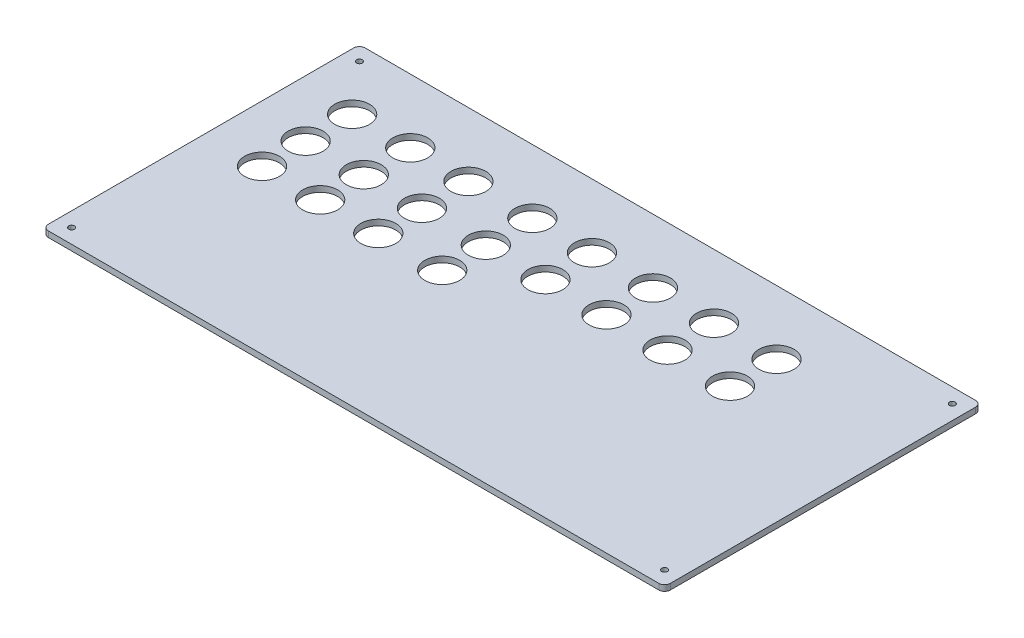
ISO-10303-21;
HEADER;
FILE_DESCRIPTION(('STEP AP214'),'2;1');
FILE_NAME('part.step','',(''),(''),'','','');
FILE_SCHEMA(('AUTOMOTIVE_DESIGN { 1 0 10303 214 1 1 1 1 }'));
ENDSEC;
DATA;
#1=APPLICATION_CONTEXT('core data for automotive mechanical design processes');
#2=APPLICATION_PROTOCOL_DEFINITION('international standard','automotive_design',2000,#1);
#3=PRODUCT_CONTEXT('',#1,'mechanical');
#4=PRODUCT('Part','Part','',(#3));
#5=PRODUCT_RELATED_PRODUCT_CATEGORY('part','',(#4));
#6=PRODUCT_DEFINITION_FORMATION('','',#4);
#7=PRODUCT_DEFINITION_CONTEXT('part definition',#1,'design');
#8=PRODUCT_DEFINITION('design','',#6,#7);
#9=PRODUCT_DEFINITION_SHAPE('','',#8);
#10=(LENGTH_UNIT() NAMED_UNIT(*) SI_UNIT(.MILLI.,.METRE.));
#11=(NAMED_UNIT(*) PLANE_ANGLE_UNIT() SI_UNIT($,.RADIAN.));
#12=(NAMED_UNIT(*) SI_UNIT($,.STERADIAN.) SOLID_ANGLE_UNIT());
#13=UNCERTAINTY_MEASURE_WITH_UNIT(LENGTH_MEASURE(1.E-05),#10,'distance_accuracy_value','');
#14=(GEOMETRIC_REPRESENTATION_CONTEXT(3) GLOBAL_UNCERTAINTY_ASSIGNED_CONTEXT((#13)) GLOBAL_UNIT_ASSIGNED_CONTEXT((#10,
#11,#12)) REPRESENTATION_CONTEXT('',''));
#15=CARTESIAN_POINT('',(0.,0.,0.));
#16=DIRECTION('',(0.,0.,1.));
#17=DIRECTION('',(1.,0.,0.));
#18=AXIS2_PLACEMENT_3D('',#15,#16,#17);
#19=CARTESIAN_POINT('',(105.,2.,-52.5));
#20=DIRECTION('',(0.,-1.,0.));
#21=DIRECTION('',(0.,0.,-1.));
#22=AXIS2_PLACEMENT_3D('',#19,#20,#21);
#23=CYLINDRICAL_SURFACE('',#22,2.);
#24=CARTESIAN_POINT('',(105.,0.,-52.5));
#25=DIRECTION('',(0.,1.,0.));
#26=DIRECTION('',(0.,0.,-1.));
#27=AXIS2_PLACEMENT_3D('',#24,#25,#26);
#28=CIRCLE('',#27,2.);
#29=CARTESIAN_POINT('',(107.,0.,-52.5));
#30=VERTEX_POINT('',#29);
#31=CARTESIAN_POINT('',(105.,0.,-54.5));
#32=VERTEX_POINT('',#31);
#33=EDGE_CURVE('E134',#30,#32,#28,.T.);
#34=ORIENTED_EDGE('',*,*,#33,.T.);
#35=DIRECTION('',(0.,-1.,0.));
#36=VECTOR('',#35,1.);
#37=CARTESIAN_POINT('',(105.,2.,-54.5));
#38=LINE('',#37,#36);
#39=CARTESIAN_POINT('',(105.,2.,-54.5));
#40=VERTEX_POINT('',#39);
#41=EDGE_CURVE('E11',#40,#32,#38,.T.);
#42=ORIENTED_EDGE('',*,*,#41,.F.);
#43=CARTESIAN_POINT('',(105.,2.,-52.5));
#44=DIRECTION('',(0.,1.,0.));
#45=DIRECTION('',(0.,0.,-1.));
#46=AXIS2_PLACEMENT_3D('',#43,#44,#45);
#47=CIRCLE('',#46,2.);
#48=CARTESIAN_POINT('',(107.,2.,-52.5));
#49=VERTEX_POINT('',#48);
#50=EDGE_CURVE('E149',#49,#40,#47,.T.);
#51=ORIENTED_EDGE('',*,*,#50,.F.);
#52=DIRECTION('',(0.,-1.,0.));
#53=VECTOR('',#52,1.);
#54=CARTESIAN_POINT('',(107.,2.,-52.5));
#55=LINE('',#54,#53);
#56=EDGE_CURVE('E130',#49,#30,#55,.T.);
#57=ORIENTED_EDGE('',*,*,#56,.T.);
#58=EDGE_LOOP('',(#34,#42,#51,#57));
#59=FACE_BOUND('',#58,.T.);
#60=ADVANCED_FACE('F36',(#59),#23,.T.);
#61=CARTESIAN_POINT('',(105.,2.,-54.5));
#62=DIRECTION('',(0.,0.,1.));
#63=DIRECTION('',(1.,0.,0.));
#64=AXIS2_PLACEMENT_3D('',#61,#62,#63);
#65=PLANE('',#64);
#66=DIRECTION('',(-1.,0.,0.));
#67=VECTOR('',#66,1.);
#68=CARTESIAN_POINT('',(105.,0.,-54.5));
#69=LINE('',#68,#67);
#70=CARTESIAN_POINT('',(-105.,0.,-54.5));
#71=VERTEX_POINT('',#70);
#72=EDGE_CURVE('E137',#32,#71,#69,.T.);
#73=ORIENTED_EDGE('',*,*,#72,.T.);
#74=DIRECTION('',(0.,-1.,0.));
#75=VECTOR('',#74,1.);
#76=CARTESIAN_POINT('',(-105.,2.,-54.5));
#77=LINE('',#76,#75);
#78=CARTESIAN_POINT('',(-105.,2.,-54.5));
#79=VERTEX_POINT('',#78);
#80=EDGE_CURVE('E45',#79,#71,#77,.T.);
#81=ORIENTED_EDGE('',*,*,#80,.F.);
#82=DIRECTION('',(-1.,0.,0.));
#83=VECTOR('',#82,1.);
#84=CARTESIAN_POINT('',(105.,2.,-54.5));
#85=LINE('',#84,#83);
#86=EDGE_CURVE('E97',#40,#79,#85,.T.);
#87=ORIENTED_EDGE('',*,*,#86,.F.);
#88=ORIENTED_EDGE('',*,*,#41,.T.);
#89=EDGE_LOOP('',(#73,#81,#87,#88));
#90=FACE_BOUND('',#89,.T.);
#91=ADVANCED_FACE('F338',(#90),#65,.F.);
#92=CARTESIAN_POINT('',(-105.,2.,-52.5));
#93=DIRECTION('',(0.,-1.,0.));
#94=DIRECTION('',(0.,0.,-1.));
#95=AXIS2_PLACEMENT_3D('',#92,#93,#94);
#96=CYLINDRICAL_SURFACE('',#95,2.);
#97=CARTESIAN_POINT('',(-105.,0.,-52.5));
#98=DIRECTION('',(0.,1.,0.));
#99=DIRECTION('',(0.,0.,1.));
#100=AXIS2_PLACEMENT_3D('',#97,#98,#99);
#101=CIRCLE('',#100,2.);
#102=CARTESIAN_POINT('',(-107.,0.,-52.5));
#103=VERTEX_POINT('',#102);
#104=EDGE_CURVE('E140',#71,#103,#101,.T.);
#105=ORIENTED_EDGE('',*,*,#104,.T.);
#106=DIRECTION('',(0.,-1.,0.));
#107=VECTOR('',#106,1.);
#108=CARTESIAN_POINT('',(-107.,2.,-52.5));
#109=LINE('',#108,#107);
#110=CARTESIAN_POINT('',(-107.,2.,-52.5));
#111=VERTEX_POINT('',#110);
#112=EDGE_CURVE('E156',#111,#103,#109,.T.);
#113=ORIENTED_EDGE('',*,*,#112,.F.);
#114=CARTESIAN_POINT('',(-105.,2.,-52.5));
#115=DIRECTION('',(0.,1.,0.));
#116=DIRECTION('',(0.,0.,1.));
#117=AXIS2_PLACEMENT_3D('',#114,#115,#116);
#118=CIRCLE('',#117,2.);
#119=EDGE_CURVE('E306',#79,#111,#118,.T.);
#120=ORIENTED_EDGE('',*,*,#119,.F.);
#121=ORIENTED_EDGE('',*,*,#80,.T.);
#122=EDGE_LOOP('',(#105,#113,#120,#121));
#123=FACE_BOUND('',#122,.T.);
#124=ADVANCED_FACE('F342',(#123),#96,.T.);
#125=CARTESIAN_POINT('',(-107.,2.,-52.5));
#126=DIRECTION('',(1.,0.,0.));
#127=DIRECTION('',(0.,0.,-1.));
#128=AXIS2_PLACEMENT_3D('',#125,#126,#127);
#129=PLANE('',#128);
#130=DIRECTION('',(0.,0.,1.));
#131=VECTOR('',#130,1.);
#132=CARTESIAN_POINT('',(-107.,0.,-52.5));
#133=LINE('',#132,#131);
#134=CARTESIAN_POINT('',(-107.,0.,52.5));
#135=VERTEX_POINT('',#134);
#136=EDGE_CURVE('E142',#103,#135,#133,.T.);
#137=ORIENTED_EDGE('',*,*,#136,.T.);
#138=DIRECTION('',(0.,-1.,0.));
#139=VECTOR('',#138,1.);
#140=CARTESIAN_POINT('',(-107.,2.,52.5));
#141=LINE('',#140,#139);
#142=CARTESIAN_POINT('',(-107.,2.,52.5));
#143=VERTEX_POINT('',#142);
#144=EDGE_CURVE('E153',#143,#135,#141,.T.);
#145=ORIENTED_EDGE('',*,*,#144,.F.);
#146=DIRECTION('',(0.,0.,1.));
#147=VECTOR('',#146,1.);
#148=CARTESIAN_POINT('',(-107.,2.,-52.5));
#149=LINE('',#148,#147);
#150=EDGE_CURVE('E308',#111,#143,#149,.T.);
#151=ORIENTED_EDGE('',*,*,#150,.F.);
#152=ORIENTED_EDGE('',*,*,#112,.T.);
#153=EDGE_LOOP('',(#137,#145,#151,#152));
#154=FACE_BOUND('',#153,.T.);
#155=ADVANCED_FACE('F314',(#154),#129,.F.);
#156=CARTESIAN_POINT('',(-105.,2.,52.5));
#157=DIRECTION('',(0.,-1.,0.));
#158=DIRECTION('',(0.,0.,-1.));
#159=AXIS2_PLACEMENT_3D('',#156,#157,#158);
#160=CYLINDRICAL_SURFACE('',#159,2.);
#161=CARTESIAN_POINT('',(-105.,0.,52.5));
#162=DIRECTION('',(0.,1.,0.));
#163=DIRECTION('',(0.,0.,-1.));
#164=AXIS2_PLACEMENT_3D('',#161,#162,#163);
#165=CIRCLE('',#164,2.);
#166=CARTESIAN_POINT('',(-105.,0.,54.5));
#167=VERTEX_POINT('',#166);
#168=EDGE_CURVE('E144',#135,#167,#165,.T.);
#169=ORIENTED_EDGE('',*,*,#168,.T.);
#170=DIRECTION('',(0.,-1.,0.));
#171=VECTOR('',#170,1.);
#172=CARTESIAN_POINT('',(-105.,2.,54.5));
#173=LINE('',#172,#171);
#174=CARTESIAN_POINT('',(-105.,2.,54.5));
#175=VERTEX_POINT('',#174);
#176=EDGE_CURVE('E125',#175,#167,#173,.T.);
#177=ORIENTED_EDGE('',*,*,#176,.F.);
#178=CARTESIAN_POINT('',(-105.,2.,52.5));
#179=DIRECTION('',(0.,1.,0.));
#180=DIRECTION('',(0.,0.,-1.));
#181=AXIS2_PLACEMENT_3D('',#178,#179,#180);
#182=CIRCLE('',#181,2.);
#183=EDGE_CURVE('E116',#143,#175,#182,.T.);
#184=ORIENTED_EDGE('',*,*,#183,.F.);
#185=ORIENTED_EDGE('',*,*,#144,.T.);
#186=EDGE_LOOP('',(#169,#177,#184,#185));
#187=FACE_BOUND('',#186,.T.);
#188=ADVANCED_FACE('F318',(#187),#160,.T.);
#189=CARTESIAN_POINT('',(105.,2.,54.5));
#190=DIRECTION('',(0.,0.,-1.));
#191=DIRECTION('',(-1.,0.,0.));
#192=AXIS2_PLACEMENT_3D('',#189,#190,#191);
#193=PLANE('',#192);
#194=DIRECTION('',(1.,0.,0.));
#195=VECTOR('',#194,1.);
#196=CARTESIAN_POINT('',(105.,0.,54.5));
#197=LINE('',#196,#195);
#198=CARTESIAN_POINT('',(105.,0.,54.5));
#199=VERTEX_POINT('',#198);
#200=EDGE_CURVE('E124',#167,#199,#197,.T.);
#201=ORIENTED_EDGE('',*,*,#200,.T.);
#202=DIRECTION('',(0.,-1.,0.));
#203=VECTOR('',#202,1.);
#204=CARTESIAN_POINT('',(105.,2.,54.5));
#205=LINE('',#204,#203);
#206=CARTESIAN_POINT('',(105.,2.,54.5));
#207=VERTEX_POINT('',#206);
#208=EDGE_CURVE('E121',#207,#199,#205,.T.);
#209=ORIENTED_EDGE('',*,*,#208,.F.);
#210=DIRECTION('',(1.,0.,0.));
#211=VECTOR('',#210,1.);
#212=CARTESIAN_POINT('',(105.,2.,54.5));
#213=LINE('',#212,#211);
#214=EDGE_CURVE('E110',#175,#207,#213,.T.);
#215=ORIENTED_EDGE('',*,*,#214,.F.);
#216=ORIENTED_EDGE('',*,*,#176,.T.);
#217=EDGE_LOOP('',(#201,#209,#215,#216));
#218=FACE_BOUND('',#217,.T.);
#219=ADVANCED_FACE('F122',(#218),#193,.F.);
#220=CARTESIAN_POINT('',(105.,2.,52.5));
#221=DIRECTION('',(0.,-1.,0.));
#222=DIRECTION('',(0.,0.,-1.));
#223=AXIS2_PLACEMENT_3D('',#220,#221,#222);
#224=CYLINDRICAL_SURFACE('',#223,2.);
#225=CARTESIAN_POINT('',(105.,0.,52.5));
#226=DIRECTION('',(0.,1.,0.));
#227=DIRECTION('',(0.,0.,-1.));
#228=AXIS2_PLACEMENT_3D('',#225,#226,#227);
#229=CIRCLE('',#228,2.);
#230=CARTESIAN_POINT('',(107.,0.,52.5));
#231=VERTEX_POINT('',#230);
#232=EDGE_CURVE('E83',#199,#231,#229,.T.);
#233=ORIENTED_EDGE('',*,*,#232,.T.);
#234=DIRECTION('',(0.,-1.,0.));
#235=VECTOR('',#234,1.);
#236=CARTESIAN_POINT('',(107.,2.,52.5));
#237=LINE('',#236,#235);
#238=CARTESIAN_POINT('',(107.,2.,52.5));
#239=VERTEX_POINT('',#238);
#240=EDGE_CURVE('E126',#239,#231,#237,.T.);
#241=ORIENTED_EDGE('',*,*,#240,.F.);
#242=CARTESIAN_POINT('',(105.,2.,52.5));
#243=DIRECTION('',(0.,1.,0.));
#244=DIRECTION('',(0.,0.,-1.));
#245=AXIS2_PLACEMENT_3D('',#242,#243,#244);
#246=CIRCLE('',#245,2.);
#247=EDGE_CURVE('E114',#207,#239,#246,.T.);
#248=ORIENTED_EDGE('',*,*,#247,.F.);
#249=ORIENTED_EDGE('',*,*,#208,.T.);
#250=EDGE_LOOP('',(#233,#241,#248,#249));
#251=FACE_BOUND('',#250,.T.);
#252=ADVANCED_FACE('F128',(#251),#224,.T.);
#253=CARTESIAN_POINT('',(107.,2.,-52.5));
#254=DIRECTION('',(-1.,0.,0.));
#255=DIRECTION('',(0.,0.,1.));
#256=AXIS2_PLACEMENT_3D('',#253,#254,#255);
#257=PLANE('',#256);
#258=DIRECTION('',(0.,0.,-1.));
#259=VECTOR('',#258,1.);
#260=CARTESIAN_POINT('',(107.,0.,-52.5));
#261=LINE('',#260,#259);
#262=EDGE_CURVE('E89',#231,#30,#261,.T.);
#263=ORIENTED_EDGE('',*,*,#262,.T.);
#264=ORIENTED_EDGE('',*,*,#56,.F.);
#265=DIRECTION('',(0.,0.,-1.));
#266=VECTOR('',#265,1.);
#267=CARTESIAN_POINT('',(107.,2.,-52.5));
#268=LINE('',#267,#266);
#269=EDGE_CURVE('E54',#239,#49,#268,.T.);
#270=ORIENTED_EDGE('',*,*,#269,.F.);
#271=ORIENTED_EDGE('',*,*,#240,.T.);
#272=EDGE_LOOP('',(#263,#264,#270,#271));
#273=FACE_BOUND('',#272,.T.);
#274=ADVANCED_FACE('F326',(#273),#257,.F.);
#275=CARTESIAN_POINT('',(105.,2.,-52.5));
#276=DIRECTION('',(0.,-1.,0.));
#277=DIRECTION('',(0.,0.,-1.));
#278=AXIS2_PLACEMENT_3D('',#275,#276,#277);
#279=PLANE('',#278);
#280=CARTESIAN_POINT('',(-102.,2.,-49.5));
#281=DIRECTION('',(0.,1.,0.));
#282=DIRECTION('',(0.,0.,1.));
#283=AXIS2_PLACEMENT_3D('',#280,#281,#282);
#284=CIRCLE('',#283,0.999999999999987);
#285=CARTESIAN_POINT('',(-102.,2.,-48.5));
#286=VERTEX_POINT('',#285);
#287=EDGE_CURVE('E239',#286,#286,#284,.T.);
#288=ORIENTED_EDGE('',*,*,#287,.F.);
#289=EDGE_LOOP('',(#288));
#290=FACE_BOUND('',#289,.T.);
#291=CARTESIAN_POINT('',(102.,2.,-49.5));
#292=DIRECTION('',(0.,1.,0.));
#293=DIRECTION('',(0.,0.,1.));
#294=AXIS2_PLACEMENT_3D('',#291,#292,#293);
#295=CIRCLE('',#294,0.999999999999987);
#296=CARTESIAN_POINT('',(102.,2.,-48.5));
#297=VERTEX_POINT('',#296);
#298=EDGE_CURVE('E228',#297,#297,#295,.T.);
#299=ORIENTED_EDGE('',*,*,#298,.F.);
#300=EDGE_LOOP('',(#299));
#301=FACE_BOUND('',#300,.T.);
#302=CARTESIAN_POINT('',(102.,2.,49.5));
#303=DIRECTION('',(0.,1.,0.));
#304=DIRECTION('',(0.,0.,1.));
#305=AXIS2_PLACEMENT_3D('',#302,#303,#304);
#306=CIRCLE('',#305,0.999999999999987);
#307=CARTESIAN_POINT('',(102.,2.,50.5));
#308=VERTEX_POINT('',#307);
#309=EDGE_CURVE('E227',#308,#308,#306,.T.);
#310=ORIENTED_EDGE('',*,*,#309,.F.);
#311=EDGE_LOOP('',(#310));
#312=FACE_BOUND('',#311,.T.);
#313=CARTESIAN_POINT('',(-102.,2.,49.5));
#314=DIRECTION('',(0.,1.,0.));
#315=DIRECTION('',(0.,0.,1.));
#316=AXIS2_PLACEMENT_3D('',#313,#314,#315);
#317=CIRCLE('',#316,0.999999999999987);
#318=CARTESIAN_POINT('',(-102.,2.,50.5));
#319=VERTEX_POINT('',#318);
#320=EDGE_CURVE('E224',#319,#319,#317,.T.);
#321=ORIENTED_EDGE('',*,*,#320,.F.);
#322=EDGE_LOOP('',(#321));
#323=FACE_BOUND('',#322,.T.);
#324=CARTESIAN_POINT('',(-67.4999999999998,2.,-16.5));
#325=DIRECTION('',(0.,1.,0.));
#326=DIRECTION('',(0.,0.,1.));
#327=AXIS2_PLACEMENT_3D('',#324,#325,#326);
#328=CIRCLE('',#327,6.);
#329=CARTESIAN_POINT('',(-67.4999999999998,2.,-10.5));
#330=VERTEX_POINT('',#329);
#331=EDGE_CURVE('E267',#330,#330,#328,.T.);
#332=ORIENTED_EDGE('',*,*,#331,.F.);
#333=EDGE_LOOP('',(#332));
#334=FACE_BOUND('',#333,.T.);
#335=CARTESIAN_POINT('',(-47.4999999999998,2.,-16.5));
#336=DIRECTION('',(0.,1.,0.));
#337=DIRECTION('',(0.,0.,1.));
#338=AXIS2_PLACEMENT_3D('',#335,#336,#337);
#339=CIRCLE('',#338,6.);
#340=CARTESIAN_POINT('',(-47.4999999999998,2.,-10.5));
#341=VERTEX_POINT('',#340);
#342=EDGE_CURVE('E271',#341,#341,#339,.T.);
#343=ORIENTED_EDGE('',*,*,#342,.F.);
#344=EDGE_LOOP('',(#343));
#345=FACE_BOUND('',#344,.T.);
#346=CARTESIAN_POINT('',(-25.4999999999998,2.,-16.5));
#347=DIRECTION('',(0.,1.,0.));
#348=DIRECTION('',(0.,0.,1.));
#349=AXIS2_PLACEMENT_3D('',#346,#347,#348);
#350=CIRCLE('',#349,6.00000000000001);
#351=CARTESIAN_POINT('',(-25.4999999999998,2.,-10.5));
#352=VERTEX_POINT('',#351);
#353=EDGE_CURVE('E274',#352,#352,#350,.T.);
#354=ORIENTED_EDGE('',*,*,#353,.F.);
#355=EDGE_LOOP('',(#354));
#356=FACE_BOUND('',#355,.T.);
#357=CARTESIAN_POINT('',(-4.99999999999982,2.,-16.5));
#358=DIRECTION('',(0.,1.,0.));
#359=DIRECTION('',(0.,0.,1.));
#360=AXIS2_PLACEMENT_3D('',#357,#358,#359);
#361=CIRCLE('',#360,6.);
#362=CARTESIAN_POINT('',(-4.99999999999982,2.,-10.5));
#363=VERTEX_POINT('',#362);
#364=EDGE_CURVE('E264',#363,#363,#361,.T.);
#365=ORIENTED_EDGE('',*,*,#364,.F.);
#366=EDGE_LOOP('',(#365));
#367=FACE_BOUND('',#366,.T.);
#368=CARTESIAN_POINT('',(-87.4999999999997,2.,-1.50000000000002));
#369=DIRECTION('',(0.,1.,0.));
#370=DIRECTION('',(0.,0.,1.));
#371=AXIS2_PLACEMENT_3D('',#368,#369,#370);
#372=CIRCLE('',#371,6.);
#373=CARTESIAN_POINT('',(-87.4999999999997,2.,4.49999999999999));
#374=VERTEX_POINT('',#373);
#375=EDGE_CURVE('E249',#374,#374,#372,.T.);
#376=ORIENTED_EDGE('',*,*,#375,.F.);
#377=EDGE_LOOP('',(#376));
#378=FACE_BOUND('',#377,.T.);
#379=CARTESIAN_POINT('',(58.5000000000002,2.,-16.5));
#380=DIRECTION('',(0.,1.,0.));
#381=DIRECTION('',(0.,0.,1.));
#382=AXIS2_PLACEMENT_3D('',#379,#380,#381);
#383=CIRCLE('',#382,6.00000000000001);
#384=CARTESIAN_POINT('',(58.5000000000002,2.,-10.5));
#385=VERTEX_POINT('',#384);
#386=EDGE_CURVE('E255',#385,#385,#383,.T.);
#387=ORIENTED_EDGE('',*,*,#386,.F.);
#388=EDGE_LOOP('',(#387));
#389=FACE_BOUND('',#388,.T.);
#390=CARTESIAN_POINT('',(37.0000000000002,2.,-16.5));
#391=DIRECTION('',(0.,1.,0.));
#392=DIRECTION('',(0.,0.,1.));
#393=AXIS2_PLACEMENT_3D('',#390,#391,#392);
#394=CIRCLE('',#393,6.);
#395=CARTESIAN_POINT('',(37.0000000000002,2.,-10.5));
#396=VERTEX_POINT('',#395);
#397=EDGE_CURVE('E258',#396,#396,#394,.T.);
#398=ORIENTED_EDGE('',*,*,#397,.F.);
#399=EDGE_LOOP('',(#398));
#400=FACE_BOUND('',#399,.T.);
#401=CARTESIAN_POINT('',(16.0000000000002,2.,-16.5));
#402=DIRECTION('',(0.,1.,0.));
#403=DIRECTION('',(0.,0.,1.));
#404=AXIS2_PLACEMENT_3D('',#401,#402,#403);
#405=CIRCLE('',#404,6.00000000000001);
#406=CARTESIAN_POINT('',(16.0000000000002,2.,-10.5));
#407=VERTEX_POINT('',#406);
#408=EDGE_CURVE('E261',#407,#407,#405,.T.);
#409=ORIENTED_EDGE('',*,*,#408,.F.);
#410=EDGE_LOOP('',(#409));
#411=FACE_BOUND('',#410,.T.);
#412=CARTESIAN_POINT('',(-67.5,2.,-32.5));
#413=DIRECTION('',(0.,1.,0.));
#414=DIRECTION('',(0.,0.,1.));
#415=AXIS2_PLACEMENT_3D('',#412,#413,#414);
#416=CIRCLE('',#415,6.);
#417=CARTESIAN_POINT('',(-67.5,2.,-26.5));
#418=VERTEX_POINT('',#417);
#419=EDGE_CURVE('E291',#418,#418,#416,.T.);
#420=ORIENTED_EDGE('',*,*,#419,.F.);
#421=EDGE_LOOP('',(#420));
#422=FACE_BOUND('',#421,.T.);
#423=CARTESIAN_POINT('',(-47.5,2.,-32.5));
#424=DIRECTION('',(0.,1.,0.));
#425=DIRECTION('',(0.,0.,1.));
#426=AXIS2_PLACEMENT_3D('',#423,#424,#425);
#427=CIRCLE('',#426,6.);
#428=CARTESIAN_POINT('',(-47.5,2.,-26.5));
#429=VERTEX_POINT('',#428);
#430=EDGE_CURVE('E294',#429,#429,#427,.T.);
#431=ORIENTED_EDGE('',*,*,#430,.F.);
#432=EDGE_LOOP('',(#431));
#433=FACE_BOUND('',#432,.T.);
#434=CARTESIAN_POINT('',(-25.5,2.,-32.5));
#435=DIRECTION('',(0.,1.,0.));
#436=DIRECTION('',(0.,0.,1.));
#437=AXIS2_PLACEMENT_3D('',#434,#435,#436);
#438=CIRCLE('',#437,6.);
#439=CARTESIAN_POINT('',(-25.5,2.,-26.5));
#440=VERTEX_POINT('',#439);
#441=EDGE_CURVE('E297',#440,#440,#438,.T.);
#442=ORIENTED_EDGE('',*,*,#441,.F.);
#443=EDGE_LOOP('',(#442));
#444=FACE_BOUND('',#443,.T.);
#445=CARTESIAN_POINT('',(-4.99999999999999,2.,-32.5));
#446=DIRECTION('',(0.,1.,0.));
#447=DIRECTION('',(0.,0.,1.));
#448=AXIS2_PLACEMENT_3D('',#445,#446,#447);
#449=CIRCLE('',#448,6.);
#450=CARTESIAN_POINT('',(-4.99999999999999,2.,-26.5));
#451=VERTEX_POINT('',#450);
#452=EDGE_CURVE('E288',#451,#451,#449,.T.);
#453=ORIENTED_EDGE('',*,*,#452,.F.);
#454=EDGE_LOOP('',(#453));
#455=FACE_BOUND('',#454,.T.);
#456=CARTESIAN_POINT('',(-87.4999999999998,2.,-16.5));
#457=DIRECTION('',(0.,1.,0.));
#458=DIRECTION('',(0.,0.,1.));
#459=AXIS2_PLACEMENT_3D('',#456,#457,#458);
#460=CIRCLE('',#459,6.);
#461=CARTESIAN_POINT('',(-87.4999999999998,2.,-10.5));
#462=VERTEX_POINT('',#461);
#463=EDGE_CURVE('E270',#462,#462,#460,.T.);
#464=ORIENTED_EDGE('',*,*,#463,.F.);
#465=EDGE_LOOP('',(#464));
#466=FACE_BOUND('',#465,.T.);
#467=CARTESIAN_POINT('',(58.5,2.,-32.5));
#468=DIRECTION('',(0.,1.,0.));
#469=DIRECTION('',(0.,0.,1.));
#470=AXIS2_PLACEMENT_3D('',#467,#468,#469);
#471=CIRCLE('',#470,6.00000000000001);
#472=CARTESIAN_POINT('',(58.5,2.,-26.5));
#473=VERTEX_POINT('',#472);
#474=EDGE_CURVE('E279',#473,#473,#471,.T.);
#475=ORIENTED_EDGE('',*,*,#474,.F.);
#476=EDGE_LOOP('',(#475));
#477=FACE_BOUND('',#476,.T.);
#478=CARTESIAN_POINT('',(37.,2.,-32.5));
#479=DIRECTION('',(0.,1.,0.));
#480=DIRECTION('',(0.,0.,1.));
#481=AXIS2_PLACEMENT_3D('',#478,#479,#480);
#482=CIRCLE('',#481,6.);
#483=CARTESIAN_POINT('',(37.,2.,-26.5));
#484=VERTEX_POINT('',#483);
#485=EDGE_CURVE('E282',#484,#484,#482,.T.);
#486=ORIENTED_EDGE('',*,*,#485,.F.);
#487=EDGE_LOOP('',(#486));
#488=FACE_BOUND('',#487,.T.);
#489=CARTESIAN_POINT('',(16.,2.,-32.5));
#490=DIRECTION('',(0.,1.,0.));
#491=DIRECTION('',(0.,0.,1.));
#492=AXIS2_PLACEMENT_3D('',#489,#490,#491);
#493=CIRCLE('',#492,6.);
#494=CARTESIAN_POINT('',(16.,2.,-26.5));
#495=VERTEX_POINT('',#494);
#496=EDGE_CURVE('E285',#495,#495,#493,.T.);
#497=ORIENTED_EDGE('',*,*,#496,.F.);
#498=EDGE_LOOP('',(#497));
#499=FACE_BOUND('',#498,.T.);
#500=CARTESIAN_POINT('',(-67.4999999999997,2.,-1.50000000000002));
#501=DIRECTION('',(0.,1.,0.));
#502=DIRECTION('',(0.,0.,1.));
#503=AXIS2_PLACEMENT_3D('',#500,#501,#502);
#504=CIRCLE('',#503,6.00000000000001);
#505=CARTESIAN_POINT('',(-67.4999999999997,2.,4.49999999999999));
#506=VERTEX_POINT('',#505);
#507=EDGE_CURVE('E246',#506,#506,#504,.T.);
#508=ORIENTED_EDGE('',*,*,#507,.F.);
#509=EDGE_LOOP('',(#508));
#510=FACE_BOUND('',#509,.T.);
#511=CARTESIAN_POINT('',(-47.4999999999997,2.,-1.50000000000002));
#512=DIRECTION('',(0.,1.,0.));
#513=DIRECTION('',(0.,0.,1.));
#514=AXIS2_PLACEMENT_3D('',#511,#512,#513);
#515=CIRCLE('',#514,6.);
#516=CARTESIAN_POINT('',(-47.4999999999997,2.,4.49999999999999));
#517=VERTEX_POINT('',#516);
#518=EDGE_CURVE('E250',#517,#517,#515,.T.);
#519=ORIENTED_EDGE('',*,*,#518,.F.);
#520=EDGE_LOOP('',(#519));
#521=FACE_BOUND('',#520,.T.);
#522=CARTESIAN_POINT('',(-25.4999999999997,2.,-1.50000000000002));
#523=DIRECTION('',(0.,1.,0.));
#524=DIRECTION('',(0.,0.,1.));
#525=AXIS2_PLACEMENT_3D('',#522,#523,#524);
#526=CIRCLE('',#525,6.00000000000001);
#527=CARTESIAN_POINT('',(-25.4999999999997,2.,4.49999999999999));
#528=VERTEX_POINT('',#527);
#529=EDGE_CURVE('E223',#528,#528,#526,.T.);
#530=ORIENTED_EDGE('',*,*,#529,.F.);
#531=EDGE_LOOP('',(#530));
#532=FACE_BOUND('',#531,.T.);
#533=CARTESIAN_POINT('',(-87.5,2.,-32.5));
#534=DIRECTION('',(0.,1.,0.));
#535=DIRECTION('',(0.,0.,1.));
#536=AXIS2_PLACEMENT_3D('',#533,#534,#535);
#537=CIRCLE('',#536,6.);
#538=CARTESIAN_POINT('',(-87.5,2.,-26.5));
#539=VERTEX_POINT('',#538);
#540=EDGE_CURVE('E165',#539,#539,#537,.T.);
#541=ORIENTED_EDGE('',*,*,#540,.F.);
#542=EDGE_LOOP('',(#541));
#543=FACE_BOUND('',#542,.T.);
#544=ORIENTED_EDGE('',*,*,#50,.T.);
#545=ORIENTED_EDGE('',*,*,#86,.T.);
#546=ORIENTED_EDGE('',*,*,#119,.T.);
#547=ORIENTED_EDGE('',*,*,#150,.T.);
#548=ORIENTED_EDGE('',*,*,#183,.T.);
#549=ORIENTED_EDGE('',*,*,#214,.T.);
#550=ORIENTED_EDGE('',*,*,#247,.T.);
#551=ORIENTED_EDGE('',*,*,#269,.T.);
#552=EDGE_LOOP('',(#544,#545,#546,#547,#548,#549,#550,#551));
#553=FACE_BOUND('',#552,.T.);
#554=ADVANCED_FACE('F112',(#290,#301,#312,#323,#334,#345,#356,#367,#378,#389,#400,#411,#422,
#433,#444,#455,#466,#477,#488,#499,#510,#521,#532,#543,#553),#279,.F.);
#555=CARTESIAN_POINT('',(105.,0.,-52.5));
#556=DIRECTION('',(0.,-1.,0.));
#557=DIRECTION('',(0.,0.,-1.));
#558=AXIS2_PLACEMENT_3D('',#555,#556,#557);
#559=PLANE('',#558);
#560=CARTESIAN_POINT('',(-102.,0.,-49.5));
#561=DIRECTION('',(0.,-1.,0.));
#562=DIRECTION('',(0.,0.,-1.));
#563=AXIS2_PLACEMENT_3D('',#560,#561,#562);
#564=CIRCLE('',#563,0.999999999999987);
#565=CARTESIAN_POINT('',(-102.,0.,-50.5));
#566=VERTEX_POINT('',#565);
#567=EDGE_CURVE('E39',#566,#566,#564,.T.);
#568=ORIENTED_EDGE('',*,*,#567,.F.);
#569=EDGE_LOOP('',(#568));
#570=FACE_BOUND('',#569,.T.);
#571=CARTESIAN_POINT('',(102.,0.,-49.5));
#572=DIRECTION('',(0.,-1.,0.));
#573=DIRECTION('',(0.,0.,-1.));
#574=AXIS2_PLACEMENT_3D('',#571,#572,#573);
#575=CIRCLE('',#574,0.999999999999987);
#576=CARTESIAN_POINT('',(102.,0.,-50.5));
#577=VERTEX_POINT('',#576);
#578=EDGE_CURVE('E225',#577,#577,#575,.T.);
#579=ORIENTED_EDGE('',*,*,#578,.F.);
#580=EDGE_LOOP('',(#579));
#581=FACE_BOUND('',#580,.T.);
#582=CARTESIAN_POINT('',(102.,0.,49.5));
#583=DIRECTION('',(0.,-1.,0.));
#584=DIRECTION('',(0.,0.,-1.));
#585=AXIS2_PLACEMENT_3D('',#582,#583,#584);
#586=CIRCLE('',#585,0.999999999999987);
#587=CARTESIAN_POINT('',(102.,0.,48.5));
#588=VERTEX_POINT('',#587);
#589=EDGE_CURVE('E232',#588,#588,#586,.T.);
#590=ORIENTED_EDGE('',*,*,#589,.F.);
#591=EDGE_LOOP('',(#590));
#592=FACE_BOUND('',#591,.T.);
#593=CARTESIAN_POINT('',(-102.,0.,49.5));
#594=DIRECTION('',(0.,-1.,0.));
#595=DIRECTION('',(0.,0.,-1.));
#596=AXIS2_PLACEMENT_3D('',#593,#594,#595);
#597=CIRCLE('',#596,0.999999999999987);
#598=CARTESIAN_POINT('',(-102.,0.,48.5));
#599=VERTEX_POINT('',#598);
#600=EDGE_CURVE('E221',#599,#599,#597,.T.);
#601=ORIENTED_EDGE('',*,*,#600,.F.);
#602=EDGE_LOOP('',(#601));
#603=FACE_BOUND('',#602,.T.);
#604=CARTESIAN_POINT('',(-67.4999999999998,0.,-16.5));
#605=DIRECTION('',(0.,-1.,0.));
#606=DIRECTION('',(0.,0.,-1.));
#607=AXIS2_PLACEMENT_3D('',#604,#605,#606);
#608=CIRCLE('',#607,6.);
#609=CARTESIAN_POINT('',(-67.4999999999998,0.,-22.5));
#610=VERTEX_POINT('',#609);
#611=EDGE_CURVE('E138',#610,#610,#608,.T.);
#612=ORIENTED_EDGE('',*,*,#611,.F.);
#613=EDGE_LOOP('',(#612));
#614=FACE_BOUND('',#613,.T.);
#615=CARTESIAN_POINT('',(-47.4999999999998,0.,-16.5));
#616=DIRECTION('',(0.,-1.,0.));
#617=DIRECTION('',(0.,0.,-1.));
#618=AXIS2_PLACEMENT_3D('',#615,#616,#617);
#619=CIRCLE('',#618,6.);
#620=CARTESIAN_POINT('',(-47.4999999999998,0.,-22.5));
#621=VERTEX_POINT('',#620);
#622=EDGE_CURVE('E216',#621,#621,#619,.T.);
#623=ORIENTED_EDGE('',*,*,#622,.F.);
#624=EDGE_LOOP('',(#623));
#625=FACE_BOUND('',#624,.T.);
#626=CARTESIAN_POINT('',(-25.4999999999998,0.,-16.5));
#627=DIRECTION('',(0.,-1.,0.));
#628=DIRECTION('',(0.,0.,-1.));
#629=AXIS2_PLACEMENT_3D('',#626,#627,#628);
#630=CIRCLE('',#629,6.00000000000001);
#631=CARTESIAN_POINT('',(-25.4999999999998,0.,-22.5));
#632=VERTEX_POINT('',#631);
#633=EDGE_CURVE('E213',#632,#632,#630,.T.);
#634=ORIENTED_EDGE('',*,*,#633,.F.);
#635=EDGE_LOOP('',(#634));
#636=FACE_BOUND('',#635,.T.);
#637=CARTESIAN_POINT('',(-4.99999999999982,0.,-16.5));
#638=DIRECTION('',(0.,-1.,0.));
#639=DIRECTION('',(0.,0.,-1.));
#640=AXIS2_PLACEMENT_3D('',#637,#638,#639);
#641=CIRCLE('',#640,6.);
#642=CARTESIAN_POINT('',(-4.99999999999982,0.,-22.5));
#643=VERTEX_POINT('',#642);
#644=EDGE_CURVE('E210',#643,#643,#641,.T.);
#645=ORIENTED_EDGE('',*,*,#644,.F.);
#646=EDGE_LOOP('',(#645));
#647=FACE_BOUND('',#646,.T.);
#648=CARTESIAN_POINT('',(-87.4999999999997,0.,-1.50000000000002));
#649=DIRECTION('',(0.,-1.,0.));
#650=DIRECTION('',(0.,0.,-1.));
#651=AXIS2_PLACEMENT_3D('',#648,#649,#650);
#652=CIRCLE('',#651,6.);
#653=CARTESIAN_POINT('',(-87.4999999999997,0.,-7.50000000000002));
#654=VERTEX_POINT('',#653);
#655=EDGE_CURVE('E207',#654,#654,#652,.T.);
#656=ORIENTED_EDGE('',*,*,#655,.F.);
#657=EDGE_LOOP('',(#656));
#658=FACE_BOUND('',#657,.T.);
#659=CARTESIAN_POINT('',(58.5000000000002,0.,-16.5));
#660=DIRECTION('',(0.,-1.,0.));
#661=DIRECTION('',(0.,0.,-1.));
#662=AXIS2_PLACEMENT_3D('',#659,#660,#661);
#663=CIRCLE('',#662,6.00000000000001);
#664=CARTESIAN_POINT('',(58.5000000000002,0.,-22.5));
#665=VERTEX_POINT('',#664);
#666=EDGE_CURVE('E204',#665,#665,#663,.T.);
#667=ORIENTED_EDGE('',*,*,#666,.F.);
#668=EDGE_LOOP('',(#667));
#669=FACE_BOUND('',#668,.T.);
#670=CARTESIAN_POINT('',(37.0000000000002,0.,-16.5));
#671=DIRECTION('',(0.,-1.,0.));
#672=DIRECTION('',(0.,0.,-1.));
#673=AXIS2_PLACEMENT_3D('',#670,#671,#672);
#674=CIRCLE('',#673,6.);
#675=CARTESIAN_POINT('',(37.0000000000002,0.,-22.5));
#676=VERTEX_POINT('',#675);
#677=EDGE_CURVE('E201',#676,#676,#674,.T.);
#678=ORIENTED_EDGE('',*,*,#677,.F.);
#679=EDGE_LOOP('',(#678));
#680=FACE_BOUND('',#679,.T.);
#681=CARTESIAN_POINT('',(16.0000000000002,0.,-16.5));
#682=DIRECTION('',(0.,-1.,0.));
#683=DIRECTION('',(0.,0.,-1.));
#684=AXIS2_PLACEMENT_3D('',#681,#682,#683);
#685=CIRCLE('',#684,6.00000000000001);
#686=CARTESIAN_POINT('',(16.0000000000002,0.,-22.5));
#687=VERTEX_POINT('',#686);
#688=EDGE_CURVE('E198',#687,#687,#685,.T.);
#689=ORIENTED_EDGE('',*,*,#688,.F.);
#690=EDGE_LOOP('',(#689));
#691=FACE_BOUND('',#690,.T.);
#692=CARTESIAN_POINT('',(-67.5,0.,-32.5));
#693=DIRECTION('',(0.,-1.,0.));
#694=DIRECTION('',(0.,0.,-1.));
#695=AXIS2_PLACEMENT_3D('',#692,#693,#694);
#696=CIRCLE('',#695,6.);
#697=CARTESIAN_POINT('',(-67.5,0.,-38.5));
#698=VERTEX_POINT('',#697);
#699=EDGE_CURVE('E195',#698,#698,#696,.T.);
#700=ORIENTED_EDGE('',*,*,#699,.F.);
#701=EDGE_LOOP('',(#700));
#702=FACE_BOUND('',#701,.T.);
#703=CARTESIAN_POINT('',(-47.5,0.,-32.5));
#704=DIRECTION('',(0.,-1.,0.));
#705=DIRECTION('',(0.,0.,-1.));
#706=AXIS2_PLACEMENT_3D('',#703,#704,#705);
#707=CIRCLE('',#706,6.);
#708=CARTESIAN_POINT('',(-47.5,0.,-38.5));
#709=VERTEX_POINT('',#708);
#710=EDGE_CURVE('E192',#709,#709,#707,.T.);
#711=ORIENTED_EDGE('',*,*,#710,.F.);
#712=EDGE_LOOP('',(#711));
#713=FACE_BOUND('',#712,.T.);
#714=CARTESIAN_POINT('',(-25.5,0.,-32.5));
#715=DIRECTION('',(0.,-1.,0.));
#716=DIRECTION('',(0.,0.,-1.));
#717=AXIS2_PLACEMENT_3D('',#714,#715,#716);
#718=CIRCLE('',#717,6.);
#719=CARTESIAN_POINT('',(-25.5,0.,-38.5));
#720=VERTEX_POINT('',#719);
#721=EDGE_CURVE('E189',#720,#720,#718,.T.);
#722=ORIENTED_EDGE('',*,*,#721,.F.);
#723=EDGE_LOOP('',(#722));
#724=FACE_BOUND('',#723,.T.);
#725=CARTESIAN_POINT('',(-4.99999999999999,0.,-32.5));
#726=DIRECTION('',(0.,-1.,0.));
#727=DIRECTION('',(0.,0.,-1.));
#728=AXIS2_PLACEMENT_3D('',#725,#726,#727);
#729=CIRCLE('',#728,6.);
#730=CARTESIAN_POINT('',(-4.99999999999999,0.,-38.5));
#731=VERTEX_POINT('',#730);
#732=EDGE_CURVE('E186',#731,#731,#729,.T.);
#733=ORIENTED_EDGE('',*,*,#732,.F.);
#734=EDGE_LOOP('',(#733));
#735=FACE_BOUND('',#734,.T.);
#736=CARTESIAN_POINT('',(-87.4999999999998,0.,-16.5));
#737=DIRECTION('',(0.,-1.,0.));
#738=DIRECTION('',(0.,0.,-1.));
#739=AXIS2_PLACEMENT_3D('',#736,#737,#738);
#740=CIRCLE('',#739,6.);
#741=CARTESIAN_POINT('',(-87.4999999999998,0.,-22.5));
#742=VERTEX_POINT('',#741);
#743=EDGE_CURVE('E183',#742,#742,#740,.T.);
#744=ORIENTED_EDGE('',*,*,#743,.F.);
#745=EDGE_LOOP('',(#744));
#746=FACE_BOUND('',#745,.T.);
#747=CARTESIAN_POINT('',(58.5,0.,-32.5));
#748=DIRECTION('',(0.,-1.,0.));
#749=DIRECTION('',(0.,0.,-1.));
#750=AXIS2_PLACEMENT_3D('',#747,#748,#749);
#751=CIRCLE('',#750,6.00000000000001);
#752=CARTESIAN_POINT('',(58.5,0.,-38.5));
#753=VERTEX_POINT('',#752);
#754=EDGE_CURVE('E180',#753,#753,#751,.T.);
#755=ORIENTED_EDGE('',*,*,#754,.F.);
#756=EDGE_LOOP('',(#755));
#757=FACE_BOUND('',#756,.T.);
#758=CARTESIAN_POINT('',(37.,0.,-32.5));
#759=DIRECTION('',(0.,-1.,0.));
#760=DIRECTION('',(0.,0.,-1.));
#761=AXIS2_PLACEMENT_3D('',#758,#759,#760);
#762=CIRCLE('',#761,6.);
#763=CARTESIAN_POINT('',(37.,0.,-38.5));
#764=VERTEX_POINT('',#763);
#765=EDGE_CURVE('E177',#764,#764,#762,.T.);
#766=ORIENTED_EDGE('',*,*,#765,.F.);
#767=EDGE_LOOP('',(#766));
#768=FACE_BOUND('',#767,.T.);
#769=CARTESIAN_POINT('',(16.,0.,-32.5));
#770=DIRECTION('',(0.,-1.,0.));
#771=DIRECTION('',(0.,0.,-1.));
#772=AXIS2_PLACEMENT_3D('',#769,#770,#771);
#773=CIRCLE('',#772,6.);
#774=CARTESIAN_POINT('',(16.,0.,-38.5));
#775=VERTEX_POINT('',#774);
#776=EDGE_CURVE('E174',#775,#775,#773,.T.);
#777=ORIENTED_EDGE('',*,*,#776,.F.);
#778=EDGE_LOOP('',(#777));
#779=FACE_BOUND('',#778,.T.);
#780=CARTESIAN_POINT('',(-67.4999999999997,0.,-1.50000000000002));
#781=DIRECTION('',(0.,-1.,0.));
#782=DIRECTION('',(0.,0.,-1.));
#783=AXIS2_PLACEMENT_3D('',#780,#781,#782);
#784=CIRCLE('',#783,6.00000000000001);
#785=CARTESIAN_POINT('',(-67.4999999999997,0.,-7.50000000000002));
#786=VERTEX_POINT('',#785);
#787=EDGE_CURVE('E171',#786,#786,#784,.T.);
#788=ORIENTED_EDGE('',*,*,#787,.F.);
#789=EDGE_LOOP('',(#788));
#790=FACE_BOUND('',#789,.T.);
#791=CARTESIAN_POINT('',(-47.4999999999997,0.,-1.50000000000002));
#792=DIRECTION('',(0.,-1.,0.));
#793=DIRECTION('',(0.,0.,-1.));
#794=AXIS2_PLACEMENT_3D('',#791,#792,#793);
#795=CIRCLE('',#794,6.);
#796=CARTESIAN_POINT('',(-47.4999999999997,0.,-7.50000000000002));
#797=VERTEX_POINT('',#796);
#798=EDGE_CURVE('E168',#797,#797,#795,.T.);
#799=ORIENTED_EDGE('',*,*,#798,.F.);
#800=EDGE_LOOP('',(#799));
#801=FACE_BOUND('',#800,.T.);
#802=CARTESIAN_POINT('',(-25.4999999999997,0.,-1.50000000000002));
#803=DIRECTION('',(0.,-1.,0.));
#804=DIRECTION('',(0.,0.,-1.));
#805=AXIS2_PLACEMENT_3D('',#802,#803,#804);
#806=CIRCLE('',#805,6.00000000000001);
#807=CARTESIAN_POINT('',(-25.4999999999997,0.,-7.50000000000002));
#808=VERTEX_POINT('',#807);
#809=EDGE_CURVE('E164',#808,#808,#806,.T.);
#810=ORIENTED_EDGE('',*,*,#809,.F.);
#811=EDGE_LOOP('',(#810));
#812=FACE_BOUND('',#811,.T.);
#813=CARTESIAN_POINT('',(-87.5,0.,-32.5));
#814=DIRECTION('',(0.,-1.,0.));
#815=DIRECTION('',(0.,0.,-1.));
#816=AXIS2_PLACEMENT_3D('',#813,#814,#815);
#817=CIRCLE('',#816,6.);
#818=CARTESIAN_POINT('',(-87.5,0.,-38.5));
#819=VERTEX_POINT('',#818);
#820=EDGE_CURVE('E161',#819,#819,#817,.T.);
#821=ORIENTED_EDGE('',*,*,#820,.F.);
#822=EDGE_LOOP('',(#821));
#823=FACE_BOUND('',#822,.T.);
#824=ORIENTED_EDGE('',*,*,#33,.F.);
#825=ORIENTED_EDGE('',*,*,#262,.F.);
#826=ORIENTED_EDGE('',*,*,#232,.F.);
#827=ORIENTED_EDGE('',*,*,#200,.F.);
#828=ORIENTED_EDGE('',*,*,#168,.F.);
#829=ORIENTED_EDGE('',*,*,#136,.F.);
#830=ORIENTED_EDGE('',*,*,#104,.F.);
#831=ORIENTED_EDGE('',*,*,#72,.F.);
#832=EDGE_LOOP('',(#824,#825,#826,#827,#828,#829,#830,#831));
#833=FACE_BOUND('',#832,.T.);
#834=ADVANCED_FACE('F321',(#570,#581,#592,#603,#614,#625,#636,#647,#658,#669,#680,#691,#702,
#713,#724,#735,#746,#757,#768,#779,#790,#801,#812,#823,#833),#559,.T.);
#835=CARTESIAN_POINT('',(-87.5,-1.,-32.5));
#836=DIRECTION('',(0.,1.,0.));
#837=DIRECTION('',(0.,0.,1.));
#838=AXIS2_PLACEMENT_3D('',#835,#836,#837);
#839=CYLINDRICAL_SURFACE('',#838,6.);
#840=ORIENTED_EDGE('',*,*,#820,.T.);
#841=EDGE_LOOP('',(#840));
#842=FACE_BOUND('',#841,.T.);
#843=ORIENTED_EDGE('',*,*,#540,.T.);
#844=EDGE_LOOP('',(#843));
#845=FACE_BOUND('',#844,.T.);
#846=ADVANCED_FACE('F372',(#842,#845),#839,.F.);
#847=CARTESIAN_POINT('',(-25.4999999999997,-1.,-1.50000000000002));
#848=DIRECTION('',(0.,1.,0.));
#849=DIRECTION('',(0.,0.,1.));
#850=AXIS2_PLACEMENT_3D('',#847,#848,#849);
#851=CYLINDRICAL_SURFACE('',#850,6.00000000000001);
#852=ORIENTED_EDGE('',*,*,#809,.T.);
#853=EDGE_LOOP('',(#852));
#854=FACE_BOUND('',#853,.T.);
#855=ORIENTED_EDGE('',*,*,#529,.T.);
#856=EDGE_LOOP('',(#855));
#857=FACE_BOUND('',#856,.T.);
#858=ADVANCED_FACE('F377',(#854,#857),#851,.F.);
#859=CARTESIAN_POINT('',(-47.4999999999997,-1.,-1.50000000000002));
#860=DIRECTION('',(0.,1.,0.));
#861=DIRECTION('',(0.,0.,1.));
#862=AXIS2_PLACEMENT_3D('',#859,#860,#861);
#863=CYLINDRICAL_SURFACE('',#862,6.);
#864=ORIENTED_EDGE('',*,*,#798,.T.);
#865=EDGE_LOOP('',(#864));
#866=FACE_BOUND('',#865,.T.);
#867=ORIENTED_EDGE('',*,*,#518,.T.);
#868=EDGE_LOOP('',(#867));
#869=FACE_BOUND('',#868,.T.);
#870=ADVANCED_FACE('F389',(#866,#869),#863,.F.);
#871=CARTESIAN_POINT('',(-67.4999999999997,-1.,-1.50000000000002));
#872=DIRECTION('',(0.,1.,0.));
#873=DIRECTION('',(0.,0.,1.));
#874=AXIS2_PLACEMENT_3D('',#871,#872,#873);
#875=CYLINDRICAL_SURFACE('',#874,6.00000000000001);
#876=ORIENTED_EDGE('',*,*,#787,.T.);
#877=EDGE_LOOP('',(#876));
#878=FACE_BOUND('',#877,.T.);
#879=ORIENTED_EDGE('',*,*,#507,.T.);
#880=EDGE_LOOP('',(#879));
#881=FACE_BOUND('',#880,.T.);
#882=ADVANCED_FACE('F399',(#878,#881),#875,.F.);
#883=CARTESIAN_POINT('',(16.,-1.,-32.5));
#884=DIRECTION('',(0.,1.,0.));
#885=DIRECTION('',(0.,0.,1.));
#886=AXIS2_PLACEMENT_3D('',#883,#884,#885);
#887=CYLINDRICAL_SURFACE('',#886,6.);
#888=ORIENTED_EDGE('',*,*,#776,.T.);
#889=EDGE_LOOP('',(#888));
#890=FACE_BOUND('',#889,.T.);
#891=ORIENTED_EDGE('',*,*,#496,.T.);
#892=EDGE_LOOP('',(#891));
#893=FACE_BOUND('',#892,.T.);
#894=ADVANCED_FACE('F409',(#890,#893),#887,.F.);
#895=CARTESIAN_POINT('',(37.,-1.,-32.5));
#896=DIRECTION('',(0.,1.,0.));
#897=DIRECTION('',(0.,0.,1.));
#898=AXIS2_PLACEMENT_3D('',#895,#896,#897);
#899=CYLINDRICAL_SURFACE('',#898,6.);
#900=ORIENTED_EDGE('',*,*,#765,.T.);
#901=EDGE_LOOP('',(#900));
#902=FACE_BOUND('',#901,.T.);
#903=ORIENTED_EDGE('',*,*,#485,.T.);
#904=EDGE_LOOP('',(#903));
#905=FACE_BOUND('',#904,.T.);
#906=ADVANCED_FACE('F419',(#902,#905),#899,.F.);
#907=CARTESIAN_POINT('',(58.5,-1.,-32.5));
#908=DIRECTION('',(0.,1.,0.));
#909=DIRECTION('',(0.,0.,1.));
#910=AXIS2_PLACEMENT_3D('',#907,#908,#909);
#911=CYLINDRICAL_SURFACE('',#910,6.00000000000001);
#912=ORIENTED_EDGE('',*,*,#754,.T.);
#913=EDGE_LOOP('',(#912));
#914=FACE_BOUND('',#913,.T.);
#915=ORIENTED_EDGE('',*,*,#474,.T.);
#916=EDGE_LOOP('',(#915));
#917=FACE_BOUND('',#916,.T.);
#918=ADVANCED_FACE('F429',(#914,#917),#911,.F.);
#919=CARTESIAN_POINT('',(-87.4999999999998,-1.,-16.5));
#920=DIRECTION('',(0.,1.,0.));
#921=DIRECTION('',(0.,0.,1.));
#922=AXIS2_PLACEMENT_3D('',#919,#920,#921);
#923=CYLINDRICAL_SURFACE('',#922,6.);
#924=ORIENTED_EDGE('',*,*,#743,.T.);
#925=EDGE_LOOP('',(#924));
#926=FACE_BOUND('',#925,.T.);
#927=ORIENTED_EDGE('',*,*,#463,.T.);
#928=EDGE_LOOP('',(#927));
#929=FACE_BOUND('',#928,.T.);
#930=ADVANCED_FACE('F439',(#926,#929),#923,.F.);
#931=CARTESIAN_POINT('',(-4.99999999999999,-1.,-32.5));
#932=DIRECTION('',(0.,1.,0.));
#933=DIRECTION('',(0.,0.,1.));
#934=AXIS2_PLACEMENT_3D('',#931,#932,#933);
#935=CYLINDRICAL_SURFACE('',#934,6.);
#936=ORIENTED_EDGE('',*,*,#732,.T.);
#937=EDGE_LOOP('',(#936));
#938=FACE_BOUND('',#937,.T.);
#939=ORIENTED_EDGE('',*,*,#452,.T.);
#940=EDGE_LOOP('',(#939));
#941=FACE_BOUND('',#940,.T.);
#942=ADVANCED_FACE('F449',(#938,#941),#935,.F.);
#943=CARTESIAN_POINT('',(-25.5,-1.,-32.5));
#944=DIRECTION('',(0.,1.,0.));
#945=DIRECTION('',(0.,0.,1.));
#946=AXIS2_PLACEMENT_3D('',#943,#944,#945);
#947=CYLINDRICAL_SURFACE('',#946,6.);
#948=ORIENTED_EDGE('',*,*,#721,.T.);
#949=EDGE_LOOP('',(#948));
#950=FACE_BOUND('',#949,.T.);
#951=ORIENTED_EDGE('',*,*,#441,.T.);
#952=EDGE_LOOP('',(#951));
#953=FACE_BOUND('',#952,.T.);
#954=ADVANCED_FACE('F459',(#950,#953),#947,.F.);
#955=CARTESIAN_POINT('',(-47.5,-1.,-32.5));
#956=DIRECTION('',(0.,1.,0.));
#957=DIRECTION('',(0.,0.,1.));
#958=AXIS2_PLACEMENT_3D('',#955,#956,#957);
#959=CYLINDRICAL_SURFACE('',#958,6.);
#960=ORIENTED_EDGE('',*,*,#710,.T.);
#961=EDGE_LOOP('',(#960));
#962=FACE_BOUND('',#961,.T.);
#963=ORIENTED_EDGE('',*,*,#430,.T.);
#964=EDGE_LOOP('',(#963));
#965=FACE_BOUND('',#964,.T.);
#966=ADVANCED_FACE('F469',(#962,#965),#959,.F.);
#967=CARTESIAN_POINT('',(-67.5,-1.,-32.5));
#968=DIRECTION('',(0.,1.,0.));
#969=DIRECTION('',(0.,0.,1.));
#970=AXIS2_PLACEMENT_3D('',#967,#968,#969);
#971=CYLINDRICAL_SURFACE('',#970,6.);
#972=ORIENTED_EDGE('',*,*,#699,.T.);
#973=EDGE_LOOP('',(#972));
#974=FACE_BOUND('',#973,.T.);
#975=ORIENTED_EDGE('',*,*,#419,.T.);
#976=EDGE_LOOP('',(#975));
#977=FACE_BOUND('',#976,.T.);
#978=ADVANCED_FACE('F479',(#974,#977),#971,.F.);
#979=CARTESIAN_POINT('',(16.0000000000002,-1.,-16.5));
#980=DIRECTION('',(0.,1.,0.));
#981=DIRECTION('',(0.,0.,1.));
#982=AXIS2_PLACEMENT_3D('',#979,#980,#981);
#983=CYLINDRICAL_SURFACE('',#982,6.00000000000001);
#984=ORIENTED_EDGE('',*,*,#688,.T.);
#985=EDGE_LOOP('',(#984));
#986=FACE_BOUND('',#985,.T.);
#987=ORIENTED_EDGE('',*,*,#408,.T.);
#988=EDGE_LOOP('',(#987));
#989=FACE_BOUND('',#988,.T.);
#990=ADVANCED_FACE('F489',(#986,#989),#983,.F.);
#991=CARTESIAN_POINT('',(37.0000000000002,-1.,-16.5));
#992=DIRECTION('',(0.,1.,0.));
#993=DIRECTION('',(0.,0.,1.));
#994=AXIS2_PLACEMENT_3D('',#991,#992,#993);
#995=CYLINDRICAL_SURFACE('',#994,6.);
#996=ORIENTED_EDGE('',*,*,#677,.T.);
#997=EDGE_LOOP('',(#996));
#998=FACE_BOUND('',#997,.T.);
#999=ORIENTED_EDGE('',*,*,#397,.T.);
#1000=EDGE_LOOP('',(#999));
#1001=FACE_BOUND('',#1000,.T.);
#1002=ADVANCED_FACE('F499',(#998,#1001),#995,.F.);
#1003=CARTESIAN_POINT('',(58.5000000000002,-1.,-16.5));
#1004=DIRECTION('',(0.,1.,0.));
#1005=DIRECTION('',(0.,0.,1.));
#1006=AXIS2_PLACEMENT_3D('',#1003,#1004,#1005);
#1007=CYLINDRICAL_SURFACE('',#1006,6.00000000000001);
#1008=ORIENTED_EDGE('',*,*,#666,.T.);
#1009=EDGE_LOOP('',(#1008));
#1010=FACE_BOUND('',#1009,.T.);
#1011=ORIENTED_EDGE('',*,*,#386,.T.);
#1012=EDGE_LOOP('',(#1011));
#1013=FACE_BOUND('',#1012,.T.);
#1014=ADVANCED_FACE('F509',(#1010,#1013),#1007,.F.);
#1015=CARTESIAN_POINT('',(-87.4999999999997,-1.,-1.50000000000002));
#1016=DIRECTION('',(0.,1.,0.));
#1017=DIRECTION('',(0.,0.,1.));
#1018=AXIS2_PLACEMENT_3D('',#1015,#1016,#1017);
#1019=CYLINDRICAL_SURFACE('',#1018,6.);
#1020=ORIENTED_EDGE('',*,*,#655,.T.);
#1021=EDGE_LOOP('',(#1020));
#1022=FACE_BOUND('',#1021,.T.);
#1023=ORIENTED_EDGE('',*,*,#375,.T.);
#1024=EDGE_LOOP('',(#1023));
#1025=FACE_BOUND('',#1024,.T.);
#1026=ADVANCED_FACE('F519',(#1022,#1025),#1019,.F.);
#1027=CARTESIAN_POINT('',(-4.99999999999982,-1.,-16.5));
#1028=DIRECTION('',(0.,1.,0.));
#1029=DIRECTION('',(0.,0.,1.));
#1030=AXIS2_PLACEMENT_3D('',#1027,#1028,#1029);
#1031=CYLINDRICAL_SURFACE('',#1030,6.);
#1032=ORIENTED_EDGE('',*,*,#644,.T.);
#1033=EDGE_LOOP('',(#1032));
#1034=FACE_BOUND('',#1033,.T.);
#1035=ORIENTED_EDGE('',*,*,#364,.T.);
#1036=EDGE_LOOP('',(#1035));
#1037=FACE_BOUND('',#1036,.T.);
#1038=ADVANCED_FACE('F529',(#1034,#1037),#1031,.F.);
#1039=CARTESIAN_POINT('',(-25.4999999999998,-1.,-16.5));
#1040=DIRECTION('',(0.,1.,0.));
#1041=DIRECTION('',(0.,0.,1.));
#1042=AXIS2_PLACEMENT_3D('',#1039,#1040,#1041);
#1043=CYLINDRICAL_SURFACE('',#1042,6.00000000000001);
#1044=ORIENTED_EDGE('',*,*,#633,.T.);
#1045=EDGE_LOOP('',(#1044));
#1046=FACE_BOUND('',#1045,.T.);
#1047=ORIENTED_EDGE('',*,*,#353,.T.);
#1048=EDGE_LOOP('',(#1047));
#1049=FACE_BOUND('',#1048,.T.);
#1050=ADVANCED_FACE('F539',(#1046,#1049),#1043,.F.);
#1051=CARTESIAN_POINT('',(-47.4999999999998,-1.,-16.5));
#1052=DIRECTION('',(0.,1.,0.));
#1053=DIRECTION('',(0.,0.,1.));
#1054=AXIS2_PLACEMENT_3D('',#1051,#1052,#1053);
#1055=CYLINDRICAL_SURFACE('',#1054,6.);
#1056=ORIENTED_EDGE('',*,*,#622,.T.);
#1057=EDGE_LOOP('',(#1056));
#1058=FACE_BOUND('',#1057,.T.);
#1059=ORIENTED_EDGE('',*,*,#342,.T.);
#1060=EDGE_LOOP('',(#1059));
#1061=FACE_BOUND('',#1060,.T.);
#1062=ADVANCED_FACE('F549',(#1058,#1061),#1055,.F.);
#1063=CARTESIAN_POINT('',(-67.4999999999998,-1.,-16.5));
#1064=DIRECTION('',(0.,1.,0.));
#1065=DIRECTION('',(0.,0.,1.));
#1066=AXIS2_PLACEMENT_3D('',#1063,#1064,#1065);
#1067=CYLINDRICAL_SURFACE('',#1066,6.);
#1068=ORIENTED_EDGE('',*,*,#611,.T.);
#1069=EDGE_LOOP('',(#1068));
#1070=FACE_BOUND('',#1069,.T.);
#1071=ORIENTED_EDGE('',*,*,#331,.T.);
#1072=EDGE_LOOP('',(#1071));
#1073=FACE_BOUND('',#1072,.T.);
#1074=ADVANCED_FACE('F559',(#1070,#1073),#1067,.F.);
#1075=CARTESIAN_POINT('',(-102.,2.,49.5));
#1076=DIRECTION('',(0.,1.,0.));
#1077=DIRECTION('',(0.,0.,1.));
#1078=AXIS2_PLACEMENT_3D('',#1075,#1076,#1077);
#1079=CYLINDRICAL_SURFACE('',#1078,0.999999999999987);
#1080=ORIENTED_EDGE('',*,*,#600,.T.);
#1081=EDGE_LOOP('',(#1080));
#1082=FACE_BOUND('',#1081,.T.);
#1083=ORIENTED_EDGE('',*,*,#320,.T.);
#1084=EDGE_LOOP('',(#1083));
#1085=FACE_BOUND('',#1084,.T.);
#1086=ADVANCED_FACE('F569',(#1082,#1085),#1079,.F.);
#1087=CARTESIAN_POINT('',(102.,2.,49.5));
#1088=DIRECTION('',(0.,1.,0.));
#1089=DIRECTION('',(0.,0.,1.));
#1090=AXIS2_PLACEMENT_3D('',#1087,#1088,#1089);
#1091=CYLINDRICAL_SURFACE('',#1090,0.999999999999987);
#1092=ORIENTED_EDGE('',*,*,#589,.T.);
#1093=EDGE_LOOP('',(#1092));
#1094=FACE_BOUND('',#1093,.T.);
#1095=ORIENTED_EDGE('',*,*,#309,.T.);
#1096=EDGE_LOOP('',(#1095));
#1097=FACE_BOUND('',#1096,.T.);
#1098=ADVANCED_FACE('F590',(#1094,#1097),#1091,.F.);
#1099=CARTESIAN_POINT('',(102.,2.,-49.5));
#1100=DIRECTION('',(0.,1.,0.));
#1101=DIRECTION('',(0.,0.,1.));
#1102=AXIS2_PLACEMENT_3D('',#1099,#1100,#1101);
#1103=CYLINDRICAL_SURFACE('',#1102,0.999999999999987);
#1104=ORIENTED_EDGE('',*,*,#578,.T.);
#1105=EDGE_LOOP('',(#1104));
#1106=FACE_BOUND('',#1105,.T.);
#1107=ORIENTED_EDGE('',*,*,#298,.T.);
#1108=EDGE_LOOP('',(#1107));
#1109=FACE_BOUND('',#1108,.T.);
#1110=ADVANCED_FACE('F600',(#1106,#1109),#1103,.F.);
#1111=CARTESIAN_POINT('',(-102.,2.,-49.5));
#1112=DIRECTION('',(0.,1.,0.));
#1113=DIRECTION('',(0.,0.,1.));
#1114=AXIS2_PLACEMENT_3D('',#1111,#1112,#1113);
#1115=CYLINDRICAL_SURFACE('',#1114,0.999999999999987);
#1116=ORIENTED_EDGE('',*,*,#567,.T.);
#1117=EDGE_LOOP('',(#1116));
#1118=FACE_BOUND('',#1117,.T.);
#1119=ORIENTED_EDGE('',*,*,#287,.T.);
#1120=EDGE_LOOP('',(#1119));
#1121=FACE_BOUND('',#1120,.T.);
#1122=ADVANCED_FACE('F610',(#1118,#1121),#1115,.F.);
#1123=CLOSED_SHELL('',(#60,#91,#124,#155,#188,#219,#252,#274,#554,#834,#846,#858,#870,#882,#894,
#906,#918,#930,#942,#954,#966,#978,#990,#1002,#1014,#1026,#1038,#1050,#1062,#1074,#1086,#1098,
#1110,#1122));
#1124=MANIFOLD_SOLID_BREP('B2',#1123);
#1125=ADVANCED_BREP_SHAPE_REPRESENTATION('',(#18,#1124),#14);
#1126=SHAPE_DEFINITION_REPRESENTATION(#9,#1125);
ENDSEC;
END-ISO-10303-21;
